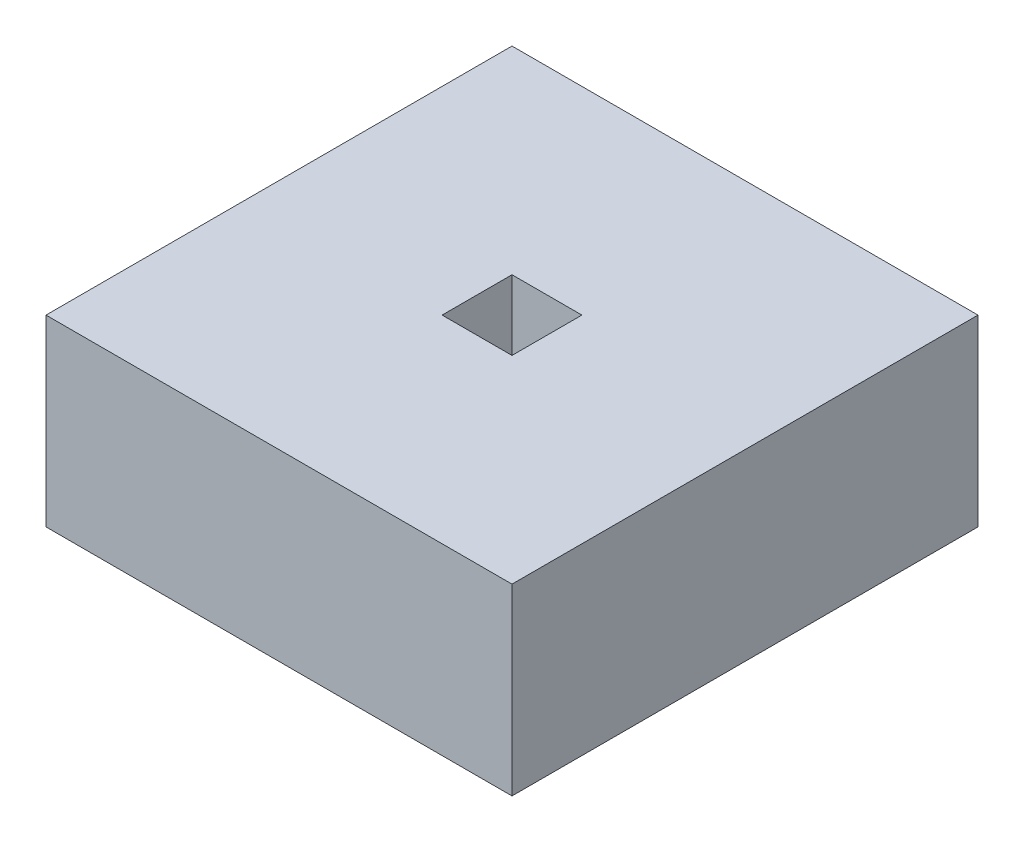
ISO-10303-21;
HEADER;
FILE_DESCRIPTION(('STEP AP214'),'2;1');
FILE_NAME('part.step','',(''),(''),'','','');
FILE_SCHEMA(('AUTOMOTIVE_DESIGN { 1 0 10303 214 1 1 1 1 }'));
ENDSEC;
DATA;
#1=APPLICATION_CONTEXT('core data for automotive mechanical design processes');
#2=APPLICATION_PROTOCOL_DEFINITION('international standard','automotive_design',2000,#1);
#3=PRODUCT_CONTEXT('',#1,'mechanical');
#4=PRODUCT('Part','Part','',(#3));
#5=PRODUCT_RELATED_PRODUCT_CATEGORY('part','',(#4));
#6=PRODUCT_DEFINITION_FORMATION('','',#4);
#7=PRODUCT_DEFINITION_CONTEXT('part definition',#1,'design');
#8=PRODUCT_DEFINITION('design','',#6,#7);
#9=PRODUCT_DEFINITION_SHAPE('','',#8);
#10=(LENGTH_UNIT() NAMED_UNIT(*) SI_UNIT(.MILLI.,.METRE.));
#11=(NAMED_UNIT(*) PLANE_ANGLE_UNIT() SI_UNIT($,.RADIAN.));
#12=(NAMED_UNIT(*) SI_UNIT($,.STERADIAN.) SOLID_ANGLE_UNIT());
#13=UNCERTAINTY_MEASURE_WITH_UNIT(LENGTH_MEASURE(1.E-05),#10,'distance_accuracy_value','');
#14=(GEOMETRIC_REPRESENTATION_CONTEXT(3) GLOBAL_UNCERTAINTY_ASSIGNED_CONTEXT((#13)) GLOBAL_UNIT_ASSIGNED_CONTEXT((#10,
#11,#12)) REPRESENTATION_CONTEXT('',''));
#15=CARTESIAN_POINT('',(0.,0.,0.));
#16=DIRECTION('',(0.,0.,1.));
#17=DIRECTION('',(1.,0.,0.));
#18=AXIS2_PLACEMENT_3D('',#15,#16,#17);
#19=CARTESIAN_POINT('',(0.,100.,0.));
#20=DIRECTION('',(0.,1.,0.));
#21=DIRECTION('',(0.,0.,1.));
#22=AXIS2_PLACEMENT_3D('',#19,#20,#21);
#23=PLANE('',#22);
#24=DIRECTION('',(0.,0.,1.));
#25=VECTOR('',#24,1.);
#26=CARTESIAN_POINT('',(-127.,100.,127.));
#27=LINE('',#26,#25);
#28=CARTESIAN_POINT('',(-127.,100.,-127.));
#29=VERTEX_POINT('',#28);
#30=CARTESIAN_POINT('',(-127.,100.,127.));
#31=VERTEX_POINT('',#30);
#32=EDGE_CURVE('E237',#29,#31,#27,.T.);
#33=ORIENTED_EDGE('',*,*,#32,.T.);
#34=DIRECTION('',(1.,0.,0.));
#35=VECTOR('',#34,1.);
#36=CARTESIAN_POINT('',(127.,100.,127.));
#37=LINE('',#36,#35);
#38=CARTESIAN_POINT('',(127.,100.,127.));
#39=VERTEX_POINT('',#38);
#40=EDGE_CURVE('E240',#31,#39,#37,.T.);
#41=ORIENTED_EDGE('',*,*,#40,.T.);
#42=DIRECTION('',(0.,0.,-1.));
#43=VECTOR('',#42,1.);
#44=CARTESIAN_POINT('',(127.,100.,127.));
#45=LINE('',#44,#43);
#46=CARTESIAN_POINT('',(127.,100.,-127.));
#47=VERTEX_POINT('',#46);
#48=EDGE_CURVE('E243',#39,#47,#45,.T.);
#49=ORIENTED_EDGE('',*,*,#48,.T.);
#50=DIRECTION('',(-1.,0.,0.));
#51=VECTOR('',#50,1.);
#52=CARTESIAN_POINT('',(127.,100.,-127.));
#53=LINE('',#52,#51);
#54=EDGE_CURVE('E245',#47,#29,#53,.T.);
#55=ORIENTED_EDGE('',*,*,#54,.T.);
#56=EDGE_LOOP('',(#33,#41,#49,#55));
#57=FACE_BOUND('',#56,.T.);
#58=DIRECTION('',(1.,0.,0.));
#59=VECTOR('',#58,1.);
#60=CARTESIAN_POINT('',(19.05,100.,19.05));
#61=LINE('',#60,#59);
#62=CARTESIAN_POINT('',(-19.05,100.,19.05));
#63=VERTEX_POINT('',#62);
#64=CARTESIAN_POINT('',(19.05,100.,19.05));
#65=VERTEX_POINT('',#64);
#66=EDGE_CURVE('E212',#63,#65,#61,.T.);
#67=ORIENTED_EDGE('',*,*,#66,.F.);
#68=DIRECTION('',(0.,0.,1.));
#69=VECTOR('',#68,1.);
#70=CARTESIAN_POINT('',(-19.05,100.,19.05));
#71=LINE('',#70,#69);
#72=CARTESIAN_POINT('',(-19.05,100.,-19.05));
#73=VERTEX_POINT('',#72);
#74=EDGE_CURVE('E210',#73,#63,#71,.T.);
#75=ORIENTED_EDGE('',*,*,#74,.F.);
#76=DIRECTION('',(-1.,0.,0.));
#77=VECTOR('',#76,1.);
#78=CARTESIAN_POINT('',(19.05,100.,-19.05));
#79=LINE('',#78,#77);
#80=CARTESIAN_POINT('',(19.05,100.,-19.05));
#81=VERTEX_POINT('',#80);
#82=EDGE_CURVE('E217',#81,#73,#79,.T.);
#83=ORIENTED_EDGE('',*,*,#82,.F.);
#84=DIRECTION('',(0.,0.,-1.));
#85=VECTOR('',#84,1.);
#86=CARTESIAN_POINT('',(19.05,100.,19.05));
#87=LINE('',#86,#85);
#88=EDGE_CURVE('E215',#65,#81,#87,.T.);
#89=ORIENTED_EDGE('',*,*,#88,.F.);
#90=EDGE_LOOP('',(#67,#75,#83,#89));
#91=FACE_BOUND('',#90,.T.);
#92=ADVANCED_FACE('F38',(#57,#91),#23,.T.);
#93=CARTESIAN_POINT('',(0.,0.,0.));
#94=DIRECTION('',(0.,1.,0.));
#95=DIRECTION('',(0.,0.,1.));
#96=AXIS2_PLACEMENT_3D('',#93,#94,#95);
#97=PLANE('',#96);
#98=DIRECTION('',(0.,0.,1.));
#99=VECTOR('',#98,1.);
#100=CARTESIAN_POINT('',(-127.,0.,127.));
#101=LINE('',#100,#99);
#102=CARTESIAN_POINT('',(-127.,0.,-127.));
#103=VERTEX_POINT('',#102);
#104=CARTESIAN_POINT('',(-127.,0.,127.));
#105=VERTEX_POINT('',#104);
#106=EDGE_CURVE('E236',#103,#105,#101,.T.);
#107=ORIENTED_EDGE('',*,*,#106,.F.);
#108=DIRECTION('',(-1.,0.,0.));
#109=VECTOR('',#108,1.);
#110=CARTESIAN_POINT('',(127.,0.,-127.));
#111=LINE('',#110,#109);
#112=CARTESIAN_POINT('',(127.,0.,-127.));
#113=VERTEX_POINT('',#112);
#114=EDGE_CURVE('E241',#113,#103,#111,.T.);
#115=ORIENTED_EDGE('',*,*,#114,.F.);
#116=DIRECTION('',(0.,0.,-1.));
#117=VECTOR('',#116,1.);
#118=CARTESIAN_POINT('',(127.,0.,127.));
#119=LINE('',#118,#117);
#120=CARTESIAN_POINT('',(127.,0.,127.));
#121=VERTEX_POINT('',#120);
#122=EDGE_CURVE('E252',#121,#113,#119,.T.);
#123=ORIENTED_EDGE('',*,*,#122,.F.);
#124=DIRECTION('',(1.,0.,0.));
#125=VECTOR('',#124,1.);
#126=CARTESIAN_POINT('',(127.,0.,127.));
#127=LINE('',#126,#125);
#128=EDGE_CURVE('E250',#105,#121,#127,.T.);
#129=ORIENTED_EDGE('',*,*,#128,.F.);
#130=EDGE_LOOP('',(#107,#115,#123,#129));
#131=FACE_BOUND('',#130,.T.);
#132=DIRECTION('',(0.,0.,1.));
#133=VECTOR('',#132,1.);
#134=CARTESIAN_POINT('',(-19.05,0.,19.05));
#135=LINE('',#134,#133);
#136=CARTESIAN_POINT('',(-19.05,0.,-19.05));
#137=VERTEX_POINT('',#136);
#138=CARTESIAN_POINT('',(-19.05,0.,19.05));
#139=VERTEX_POINT('',#138);
#140=EDGE_CURVE('E61',#137,#139,#135,.T.);
#141=ORIENTED_EDGE('',*,*,#140,.T.);
#142=DIRECTION('',(1.,0.,0.));
#143=VECTOR('',#142,1.);
#144=CARTESIAN_POINT('',(19.05,0.,19.05));
#145=LINE('',#144,#143);
#146=CARTESIAN_POINT('',(19.05,0.,19.05));
#147=VERTEX_POINT('',#146);
#148=EDGE_CURVE('E221',#139,#147,#145,.T.);
#149=ORIENTED_EDGE('',*,*,#148,.T.);
#150=DIRECTION('',(0.,0.,-1.));
#151=VECTOR('',#150,1.);
#152=CARTESIAN_POINT('',(19.05,0.,19.05));
#153=LINE('',#152,#151);
#154=CARTESIAN_POINT('',(19.05,0.,-19.05));
#155=VERTEX_POINT('',#154);
#156=EDGE_CURVE('E225',#147,#155,#153,.T.);
#157=ORIENTED_EDGE('',*,*,#156,.T.);
#158=DIRECTION('',(-1.,0.,0.));
#159=VECTOR('',#158,1.);
#160=CARTESIAN_POINT('',(19.05,0.,-19.05));
#161=LINE('',#160,#159);
#162=EDGE_CURVE('E213',#155,#137,#161,.T.);
#163=ORIENTED_EDGE('',*,*,#162,.T.);
#164=EDGE_LOOP('',(#141,#149,#157,#163));
#165=FACE_BOUND('',#164,.T.);
#166=ADVANCED_FACE('F270',(#131,#165),#97,.F.);
#167=CARTESIAN_POINT('',(-127.,100.,127.));
#168=DIRECTION('',(1.,0.,0.));
#169=DIRECTION('',(0.,0.,-1.));
#170=AXIS2_PLACEMENT_3D('',#167,#168,#169);
#171=PLANE('',#170);
#172=ORIENTED_EDGE('',*,*,#106,.T.);
#173=DIRECTION('',(0.,-1.,0.));
#174=VECTOR('',#173,1.);
#175=CARTESIAN_POINT('',(-127.,100.,127.));
#176=LINE('',#175,#174);
#177=EDGE_CURVE('E12',#31,#105,#176,.T.);
#178=ORIENTED_EDGE('',*,*,#177,.F.);
#179=ORIENTED_EDGE('',*,*,#32,.F.);
#180=DIRECTION('',(0.,-1.,0.));
#181=VECTOR('',#180,1.);
#182=CARTESIAN_POINT('',(-127.,100.,-127.));
#183=LINE('',#182,#181);
#184=EDGE_CURVE('E247',#29,#103,#183,.T.);
#185=ORIENTED_EDGE('',*,*,#184,.T.);
#186=EDGE_LOOP('',(#172,#178,#179,#185));
#187=FACE_BOUND('',#186,.T.);
#188=ADVANCED_FACE('F40',(#187),#171,.F.);
#189=CARTESIAN_POINT('',(127.,100.,127.));
#190=DIRECTION('',(0.,0.,-1.));
#191=DIRECTION('',(-1.,0.,0.));
#192=AXIS2_PLACEMENT_3D('',#189,#190,#191);
#193=PLANE('',#192);
#194=ORIENTED_EDGE('',*,*,#128,.T.);
#195=DIRECTION('',(0.,-1.,0.));
#196=VECTOR('',#195,1.);
#197=CARTESIAN_POINT('',(127.,100.,127.));
#198=LINE('',#197,#196);
#199=EDGE_CURVE('E46',#39,#121,#198,.T.);
#200=ORIENTED_EDGE('',*,*,#199,.F.);
#201=ORIENTED_EDGE('',*,*,#40,.F.);
#202=ORIENTED_EDGE('',*,*,#177,.T.);
#203=EDGE_LOOP('',(#194,#200,#201,#202));
#204=FACE_BOUND('',#203,.T.);
#205=ADVANCED_FACE('F281',(#204),#193,.F.);
#206=CARTESIAN_POINT('',(127.,100.,127.));
#207=DIRECTION('',(-1.,0.,0.));
#208=DIRECTION('',(0.,0.,1.));
#209=AXIS2_PLACEMENT_3D('',#206,#207,#208);
#210=PLANE('',#209);
#211=ORIENTED_EDGE('',*,*,#122,.T.);
#212=DIRECTION('',(0.,-1.,0.));
#213=VECTOR('',#212,1.);
#214=CARTESIAN_POINT('',(127.,100.,-127.));
#215=LINE('',#214,#213);
#216=EDGE_CURVE('E257',#47,#113,#215,.T.);
#217=ORIENTED_EDGE('',*,*,#216,.F.);
#218=ORIENTED_EDGE('',*,*,#48,.F.);
#219=ORIENTED_EDGE('',*,*,#199,.T.);
#220=EDGE_LOOP('',(#211,#217,#218,#219));
#221=FACE_BOUND('',#220,.T.);
#222=ADVANCED_FACE('F264',(#221),#210,.F.);
#223=CARTESIAN_POINT('',(127.,100.,-127.));
#224=DIRECTION('',(0.,0.,1.));
#225=DIRECTION('',(1.,0.,0.));
#226=AXIS2_PLACEMENT_3D('',#223,#224,#225);
#227=PLANE('',#226);
#228=ORIENTED_EDGE('',*,*,#114,.T.);
#229=ORIENTED_EDGE('',*,*,#184,.F.);
#230=ORIENTED_EDGE('',*,*,#54,.F.);
#231=ORIENTED_EDGE('',*,*,#216,.T.);
#232=EDGE_LOOP('',(#228,#229,#230,#231));
#233=FACE_BOUND('',#232,.T.);
#234=ADVANCED_FACE('F274',(#233),#227,.F.);
#235=CARTESIAN_POINT('',(-19.05,100.,19.05));
#236=DIRECTION('',(1.,0.,0.));
#237=DIRECTION('',(0.,0.,-1.));
#238=AXIS2_PLACEMENT_3D('',#235,#236,#237);
#239=PLANE('',#238);
#240=ORIENTED_EDGE('',*,*,#140,.F.);
#241=DIRECTION('',(0.,-1.,0.));
#242=VECTOR('',#241,1.);
#243=CARTESIAN_POINT('',(-19.05,100.,-19.05));
#244=LINE('',#243,#242);
#245=EDGE_CURVE('E219',#73,#137,#244,.T.);
#246=ORIENTED_EDGE('',*,*,#245,.F.);
#247=ORIENTED_EDGE('',*,*,#74,.T.);
#248=DIRECTION('',(0.,-1.,0.));
#249=VECTOR('',#248,1.);
#250=CARTESIAN_POINT('',(-19.05,100.,19.05));
#251=LINE('',#250,#249);
#252=EDGE_CURVE('E234',#63,#139,#251,.T.);
#253=ORIENTED_EDGE('',*,*,#252,.T.);
#254=EDGE_LOOP('',(#240,#246,#247,#253));
#255=FACE_BOUND('',#254,.T.);
#256=ADVANCED_FACE('F295',(#255),#239,.T.);
#257=CARTESIAN_POINT('',(19.05,100.,19.05));
#258=DIRECTION('',(0.,0.,-1.));
#259=DIRECTION('',(-1.,0.,0.));
#260=AXIS2_PLACEMENT_3D('',#257,#258,#259);
#261=PLANE('',#260);
#262=ORIENTED_EDGE('',*,*,#148,.F.);
#263=ORIENTED_EDGE('',*,*,#252,.F.);
#264=ORIENTED_EDGE('',*,*,#66,.T.);
#265=DIRECTION('',(0.,-1.,0.));
#266=VECTOR('',#265,1.);
#267=CARTESIAN_POINT('',(19.05,100.,19.05));
#268=LINE('',#267,#266);
#269=EDGE_CURVE('E232',#65,#147,#268,.T.);
#270=ORIENTED_EDGE('',*,*,#269,.T.);
#271=EDGE_LOOP('',(#262,#263,#264,#270));
#272=FACE_BOUND('',#271,.T.);
#273=ADVANCED_FACE('F302',(#272),#261,.T.);
#274=CARTESIAN_POINT('',(19.05,100.,19.05));
#275=DIRECTION('',(-1.,0.,0.));
#276=DIRECTION('',(0.,0.,1.));
#277=AXIS2_PLACEMENT_3D('',#274,#275,#276);
#278=PLANE('',#277);
#279=ORIENTED_EDGE('',*,*,#156,.F.);
#280=ORIENTED_EDGE('',*,*,#269,.F.);
#281=ORIENTED_EDGE('',*,*,#88,.T.);
#282=DIRECTION('',(0.,-1.,0.));
#283=VECTOR('',#282,1.);
#284=CARTESIAN_POINT('',(19.05,100.,-19.05));
#285=LINE('',#284,#283);
#286=EDGE_CURVE('E53',#81,#155,#285,.T.);
#287=ORIENTED_EDGE('',*,*,#286,.T.);
#288=EDGE_LOOP('',(#279,#280,#281,#287));
#289=FACE_BOUND('',#288,.T.);
#290=ADVANCED_FACE('F306',(#289),#278,.T.);
#291=CARTESIAN_POINT('',(19.05,100.,-19.05));
#292=DIRECTION('',(0.,0.,1.));
#293=DIRECTION('',(1.,0.,0.));
#294=AXIS2_PLACEMENT_3D('',#291,#292,#293);
#295=PLANE('',#294);
#296=ORIENTED_EDGE('',*,*,#162,.F.);
#297=ORIENTED_EDGE('',*,*,#286,.F.);
#298=ORIENTED_EDGE('',*,*,#82,.T.);
#299=ORIENTED_EDGE('',*,*,#245,.T.);
#300=EDGE_LOOP('',(#296,#297,#298,#299));
#301=FACE_BOUND('',#300,.T.);
#302=ADVANCED_FACE('F311',(#301),#295,.T.);
#303=CLOSED_SHELL('',(#92,#166,#188,#205,#222,#234,#256,#273,#290,#302));
#304=CARTESIAN_POINT('',(-126.,-356.38181771802,126.));
#305=DIRECTION('',(0.,0.,1.));
#306=DIRECTION('',(1.,0.,0.));
#307=AXIS2_PLACEMENT_3D('',#304,#305,#306);
#308=PLANE('',#307);
#309=DIRECTION('',(-1.,0.,0.));
#310=VECTOR('',#309,1.);
#311=CARTESIAN_POINT('',(-126.,1.,126.));
#312=LINE('',#311,#310);
#313=CARTESIAN_POINT('',(126.,1.,126.));
#314=VERTEX_POINT('',#313);
#315=CARTESIAN_POINT('',(-126.,1.,126.));
#316=VERTEX_POINT('',#315);
#317=EDGE_CURVE('E222',#314,#316,#312,.T.);
#318=ORIENTED_EDGE('',*,*,#317,.T.);
#319=DIRECTION('',(0.,1.,0.));
#320=VECTOR('',#319,1.);
#321=CARTESIAN_POINT('',(-126.,-356.38181771802,126.));
#322=LINE('',#321,#320);
#323=CARTESIAN_POINT('',(-126.,99.,126.));
#324=VERTEX_POINT('',#323);
#325=EDGE_CURVE('E200',#316,#324,#322,.T.);
#326=ORIENTED_EDGE('',*,*,#325,.T.);
#327=DIRECTION('',(1.,0.,0.));
#328=VECTOR('',#327,1.);
#329=CARTESIAN_POINT('',(-126.,99.,126.));
#330=LINE('',#329,#328);
#331=CARTESIAN_POINT('',(126.,99.,126.));
#332=VERTEX_POINT('',#331);
#333=EDGE_CURVE('E191',#324,#332,#330,.T.);
#334=ORIENTED_EDGE('',*,*,#333,.T.);
#335=DIRECTION('',(0.,1.,0.));
#336=VECTOR('',#335,1.);
#337=CARTESIAN_POINT('',(126.,-356.38181771802,126.));
#338=LINE('',#337,#336);
#339=EDGE_CURVE('E205',#314,#332,#338,.T.);
#340=ORIENTED_EDGE('',*,*,#339,.F.);
#341=EDGE_LOOP('',(#318,#326,#334,#340));
#342=FACE_BOUND('',#341,.T.);
#343=ADVANCED_FACE('F323',(#342),#308,.F.);
#344=CARTESIAN_POINT('',(126.,-356.38181771802,126.));
#345=DIRECTION('',(1.,0.,0.));
#346=DIRECTION('',(0.,0.,-1.));
#347=AXIS2_PLACEMENT_3D('',#344,#345,#346);
#348=PLANE('',#347);
#349=DIRECTION('',(0.,0.,1.));
#350=VECTOR('',#349,1.);
#351=CARTESIAN_POINT('',(126.,1.,126.));
#352=LINE('',#351,#350);
#353=CARTESIAN_POINT('',(126.,1.,-126.));
#354=VERTEX_POINT('',#353);
#355=EDGE_CURVE('E209',#354,#314,#352,.T.);
#356=ORIENTED_EDGE('',*,*,#355,.T.);
#357=ORIENTED_EDGE('',*,*,#339,.T.);
#358=DIRECTION('',(0.,0.,-1.));
#359=VECTOR('',#358,1.);
#360=CARTESIAN_POINT('',(126.,99.,126.));
#361=LINE('',#360,#359);
#362=CARTESIAN_POINT('',(126.,99.,-126.));
#363=VERTEX_POINT('',#362);
#364=EDGE_CURVE('E194',#332,#363,#361,.T.);
#365=ORIENTED_EDGE('',*,*,#364,.T.);
#366=DIRECTION('',(0.,1.,0.));
#367=VECTOR('',#366,1.);
#368=CARTESIAN_POINT('',(126.,-356.38181771802,-126.));
#369=LINE('',#368,#367);
#370=EDGE_CURVE('E203',#354,#363,#369,.T.);
#371=ORIENTED_EDGE('',*,*,#370,.F.);
#372=EDGE_LOOP('',(#356,#357,#365,#371));
#373=FACE_BOUND('',#372,.T.);
#374=ADVANCED_FACE('F326',(#373),#348,.F.);
#375=CARTESIAN_POINT('',(126.,-356.38181771802,-126.));
#376=DIRECTION('',(0.,0.,-1.));
#377=DIRECTION('',(-1.,0.,0.));
#378=AXIS2_PLACEMENT_3D('',#375,#376,#377);
#379=PLANE('',#378);
#380=DIRECTION('',(1.,0.,0.));
#381=VECTOR('',#380,1.);
#382=CARTESIAN_POINT('',(126.,1.,-126.));
#383=LINE('',#382,#381);
#384=CARTESIAN_POINT('',(-126.,1.,-126.));
#385=VERTEX_POINT('',#384);
#386=EDGE_CURVE('E371',#385,#354,#383,.T.);
#387=ORIENTED_EDGE('',*,*,#386,.T.);
#388=ORIENTED_EDGE('',*,*,#370,.T.);
#389=DIRECTION('',(-1.,0.,0.));
#390=VECTOR('',#389,1.);
#391=CARTESIAN_POINT('',(126.,99.,-126.));
#392=LINE('',#391,#390);
#393=CARTESIAN_POINT('',(-126.,99.,-126.));
#394=VERTEX_POINT('',#393);
#395=EDGE_CURVE('E197',#363,#394,#392,.T.);
#396=ORIENTED_EDGE('',*,*,#395,.T.);
#397=DIRECTION('',(0.,1.,0.));
#398=VECTOR('',#397,1.);
#399=CARTESIAN_POINT('',(-126.,-356.38181771802,-126.));
#400=LINE('',#399,#398);
#401=EDGE_CURVE('E201',#385,#394,#400,.T.);
#402=ORIENTED_EDGE('',*,*,#401,.F.);
#403=EDGE_LOOP('',(#387,#388,#396,#402));
#404=FACE_BOUND('',#403,.T.);
#405=ADVANCED_FACE('F320',(#404),#379,.F.);
#406=CARTESIAN_POINT('',(-126.,-356.38181771802,-126.));
#407=DIRECTION('',(-1.,0.,0.));
#408=DIRECTION('',(0.,0.,1.));
#409=AXIS2_PLACEMENT_3D('',#406,#407,#408);
#410=PLANE('',#409);
#411=DIRECTION('',(0.,0.,-1.));
#412=VECTOR('',#411,1.);
#413=CARTESIAN_POINT('',(-126.,1.,-126.));
#414=LINE('',#413,#412);
#415=EDGE_CURVE('E358',#316,#385,#414,.T.);
#416=ORIENTED_EDGE('',*,*,#415,.T.);
#417=ORIENTED_EDGE('',*,*,#401,.T.);
#418=DIRECTION('',(0.,0.,1.));
#419=VECTOR('',#418,1.);
#420=CARTESIAN_POINT('',(-126.,99.,-126.));
#421=LINE('',#420,#419);
#422=EDGE_CURVE('E186',#394,#324,#421,.T.);
#423=ORIENTED_EDGE('',*,*,#422,.T.);
#424=ORIENTED_EDGE('',*,*,#325,.F.);
#425=EDGE_LOOP('',(#416,#417,#423,#424));
#426=FACE_BOUND('',#425,.T.);
#427=ADVANCED_FACE('F317',(#426),#410,.F.);
#428=CARTESIAN_POINT('',(0.,99.,0.));
#429=DIRECTION('',(0.,1.,0.));
#430=DIRECTION('',(0.,0.,1.));
#431=AXIS2_PLACEMENT_3D('',#428,#429,#430);
#432=PLANE('',#431);
#433=DIRECTION('',(1.,0.,0.));
#434=VECTOR('',#433,1.);
#435=CARTESIAN_POINT('',(-20.05,99.,20.05));
#436=LINE('',#435,#434);
#437=CARTESIAN_POINT('',(-20.05,99.,20.05));
#438=VERTEX_POINT('',#437);
#439=CARTESIAN_POINT('',(20.05,99.,20.05));
#440=VERTEX_POINT('',#439);
#441=EDGE_CURVE('E175',#438,#440,#436,.T.);
#442=ORIENTED_EDGE('',*,*,#441,.T.);
#443=DIRECTION('',(0.,0.,-1.));
#444=VECTOR('',#443,1.);
#445=CARTESIAN_POINT('',(20.05,99.,20.05));
#446=LINE('',#445,#444);
#447=CARTESIAN_POINT('',(20.05,99.,-20.05));
#448=VERTEX_POINT('',#447);
#449=EDGE_CURVE('E157',#440,#448,#446,.T.);
#450=ORIENTED_EDGE('',*,*,#449,.T.);
#451=DIRECTION('',(-1.,0.,0.));
#452=VECTOR('',#451,1.);
#453=CARTESIAN_POINT('',(20.05,99.,-20.05));
#454=LINE('',#453,#452);
#455=CARTESIAN_POINT('',(-20.05,99.,-20.05));
#456=VERTEX_POINT('',#455);
#457=EDGE_CURVE('E172',#448,#456,#454,.T.);
#458=ORIENTED_EDGE('',*,*,#457,.T.);
#459=DIRECTION('',(0.,0.,1.));
#460=VECTOR('',#459,1.);
#461=CARTESIAN_POINT('',(-20.05,99.,-20.05));
#462=LINE('',#461,#460);
#463=EDGE_CURVE('E179',#456,#438,#462,.T.);
#464=ORIENTED_EDGE('',*,*,#463,.T.);
#465=EDGE_LOOP('',(#442,#450,#458,#464));
#466=FACE_BOUND('',#465,.T.);
#467=ORIENTED_EDGE('',*,*,#422,.F.);
#468=ORIENTED_EDGE('',*,*,#395,.F.);
#469=ORIENTED_EDGE('',*,*,#364,.F.);
#470=ORIENTED_EDGE('',*,*,#333,.F.);
#471=EDGE_LOOP('',(#467,#468,#469,#470));
#472=FACE_BOUND('',#471,.T.);
#473=ADVANCED_FACE('F169',(#466,#472),#432,.F.);
#474=CARTESIAN_POINT('',(20.05,-356.38181771802,20.05));
#475=DIRECTION('',(1.,0.,0.));
#476=DIRECTION('',(0.,0.,-1.));
#477=AXIS2_PLACEMENT_3D('',#474,#475,#476);
#478=PLANE('',#477);
#479=DIRECTION('',(0.,1.,0.));
#480=VECTOR('',#479,1.);
#481=CARTESIAN_POINT('',(20.05,-356.38181771802,-20.05));
#482=LINE('',#481,#480);
#483=CARTESIAN_POINT('',(20.05,1.,-20.05));
#484=VERTEX_POINT('',#483);
#485=EDGE_CURVE('E153',#484,#448,#482,.T.);
#486=ORIENTED_EDGE('',*,*,#485,.T.);
#487=ORIENTED_EDGE('',*,*,#449,.F.);
#488=DIRECTION('',(0.,1.,0.));
#489=VECTOR('',#488,1.);
#490=CARTESIAN_POINT('',(20.05,-356.38181771802,20.05));
#491=LINE('',#490,#489);
#492=CARTESIAN_POINT('',(20.05,1.,20.05));
#493=VERTEX_POINT('',#492);
#494=EDGE_CURVE('E164',#493,#440,#491,.T.);
#495=ORIENTED_EDGE('',*,*,#494,.F.);
#496=DIRECTION('',(0.,0.,1.));
#497=VECTOR('',#496,1.);
#498=CARTESIAN_POINT('',(20.05,1.,20.05));
#499=LINE('',#498,#497);
#500=EDGE_CURVE('E159',#484,#493,#499,.T.);
#501=ORIENTED_EDGE('',*,*,#500,.F.);
#502=EDGE_LOOP('',(#486,#487,#495,#501));
#503=FACE_BOUND('',#502,.T.);
#504=ADVANCED_FACE('F155',(#503),#478,.T.);
#505=CARTESIAN_POINT('',(20.05,-356.38181771802,-20.05));
#506=DIRECTION('',(0.,0.,-1.));
#507=DIRECTION('',(-1.,0.,0.));
#508=AXIS2_PLACEMENT_3D('',#505,#506,#507);
#509=PLANE('',#508);
#510=DIRECTION('',(0.,1.,0.));
#511=VECTOR('',#510,1.);
#512=CARTESIAN_POINT('',(-20.05,-356.38181771802,-20.05));
#513=LINE('',#512,#511);
#514=CARTESIAN_POINT('',(-20.05,1.,-20.05));
#515=VERTEX_POINT('',#514);
#516=EDGE_CURVE('E163',#515,#456,#513,.T.);
#517=ORIENTED_EDGE('',*,*,#516,.T.);
#518=ORIENTED_EDGE('',*,*,#457,.F.);
#519=ORIENTED_EDGE('',*,*,#485,.F.);
#520=DIRECTION('',(1.,0.,0.));
#521=VECTOR('',#520,1.);
#522=CARTESIAN_POINT('',(20.05,1.,-20.05));
#523=LINE('',#522,#521);
#524=EDGE_CURVE('E363',#515,#484,#523,.T.);
#525=ORIENTED_EDGE('',*,*,#524,.F.);
#526=EDGE_LOOP('',(#517,#518,#519,#525));
#527=FACE_BOUND('',#526,.T.);
#528=ADVANCED_FACE('F177',(#527),#509,.T.);
#529=CARTESIAN_POINT('',(-20.05,-356.38181771802,-20.05));
#530=DIRECTION('',(-1.,0.,0.));
#531=DIRECTION('',(0.,0.,1.));
#532=AXIS2_PLACEMENT_3D('',#529,#530,#531);
#533=PLANE('',#532);
#534=DIRECTION('',(0.,1.,0.));
#535=VECTOR('',#534,1.);
#536=CARTESIAN_POINT('',(-20.05,-356.38181771802,20.05));
#537=LINE('',#536,#535);
#538=CARTESIAN_POINT('',(-20.05,1.,20.05));
#539=VERTEX_POINT('',#538);
#540=EDGE_CURVE('E184',#539,#438,#537,.T.);
#541=ORIENTED_EDGE('',*,*,#540,.T.);
#542=ORIENTED_EDGE('',*,*,#463,.F.);
#543=ORIENTED_EDGE('',*,*,#516,.F.);
#544=DIRECTION('',(0.,0.,-1.));
#545=VECTOR('',#544,1.);
#546=CARTESIAN_POINT('',(-20.05,1.,-20.05));
#547=LINE('',#546,#545);
#548=EDGE_CURVE('E364',#539,#515,#547,.T.);
#549=ORIENTED_EDGE('',*,*,#548,.F.);
#550=EDGE_LOOP('',(#541,#542,#543,#549));
#551=FACE_BOUND('',#550,.T.);
#552=ADVANCED_FACE('F340',(#551),#533,.T.);
#553=CARTESIAN_POINT('',(-20.05,-356.38181771802,20.05));
#554=DIRECTION('',(0.,0.,1.));
#555=DIRECTION('',(1.,0.,0.));
#556=AXIS2_PLACEMENT_3D('',#553,#554,#555);
#557=PLANE('',#556);
#558=ORIENTED_EDGE('',*,*,#494,.T.);
#559=ORIENTED_EDGE('',*,*,#441,.F.);
#560=ORIENTED_EDGE('',*,*,#540,.F.);
#561=DIRECTION('',(-1.,0.,0.));
#562=VECTOR('',#561,1.);
#563=CARTESIAN_POINT('',(-20.05,1.,20.05));
#564=LINE('',#563,#562);
#565=EDGE_CURVE('E362',#493,#539,#564,.T.);
#566=ORIENTED_EDGE('',*,*,#565,.F.);
#567=EDGE_LOOP('',(#558,#559,#560,#566));
#568=FACE_BOUND('',#567,.T.);
#569=ADVANCED_FACE('F336',(#568),#557,.T.);
#570=CARTESIAN_POINT('',(0.,1.,0.));
#571=DIRECTION('',(0.,1.,0.));
#572=DIRECTION('',(0.,0.,1.));
#573=AXIS2_PLACEMENT_3D('',#570,#571,#572);
#574=PLANE('',#573);
#575=ORIENTED_EDGE('',*,*,#415,.F.);
#576=ORIENTED_EDGE('',*,*,#317,.F.);
#577=ORIENTED_EDGE('',*,*,#355,.F.);
#578=ORIENTED_EDGE('',*,*,#386,.F.);
#579=EDGE_LOOP('',(#575,#576,#577,#578));
#580=FACE_BOUND('',#579,.T.);
#581=ORIENTED_EDGE('',*,*,#500,.T.);
#582=ORIENTED_EDGE('',*,*,#565,.T.);
#583=ORIENTED_EDGE('',*,*,#548,.T.);
#584=ORIENTED_EDGE('',*,*,#524,.T.);
#585=EDGE_LOOP('',(#581,#582,#583,#584));
#586=FACE_BOUND('',#585,.T.);
#587=ADVANCED_FACE('F339',(#580,#586),#574,.T.);
#588=CLOSED_SHELL('',(#343,#374,#405,#427,#473,#504,#528,#552,#569,#587));
#589=ORIENTED_CLOSED_SHELL('',*,#588,.T.);
#590=BREP_WITH_VOIDS('B2',#303,(#589));
#591=ADVANCED_BREP_SHAPE_REPRESENTATION('',(#18,#590),#14);
#592=SHAPE_DEFINITION_REPRESENTATION(#9,#591);
ENDSEC;
END-ISO-10303-21;
